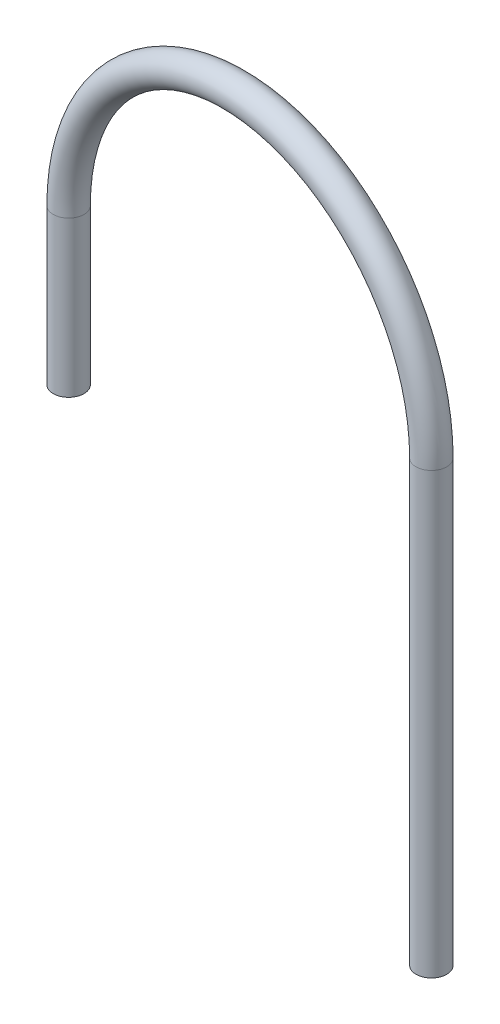
ISO-10303-21;
HEADER;
FILE_DESCRIPTION(('STEP AP214'),'2;1');
FILE_NAME('part.step','',(''),(''),'','','');
FILE_SCHEMA(('AUTOMOTIVE_DESIGN { 1 0 10303 214 1 1 1 1 }'));
ENDSEC;
DATA;
#1=APPLICATION_CONTEXT('core data for automotive mechanical design processes');
#2=APPLICATION_PROTOCOL_DEFINITION('international standard','automotive_design',2000,#1);
#3=PRODUCT_CONTEXT('',#1,'mechanical');
#4=PRODUCT('Part','Part','',(#3));
#5=PRODUCT_RELATED_PRODUCT_CATEGORY('part','',(#4));
#6=PRODUCT_DEFINITION_FORMATION('','',#4);
#7=PRODUCT_DEFINITION_CONTEXT('part definition',#1,'design');
#8=PRODUCT_DEFINITION('design','',#6,#7);
#9=PRODUCT_DEFINITION_SHAPE('','',#8);
#10=(LENGTH_UNIT() NAMED_UNIT(*) SI_UNIT(.MILLI.,.METRE.));
#11=(NAMED_UNIT(*) PLANE_ANGLE_UNIT() SI_UNIT($,.RADIAN.));
#12=(NAMED_UNIT(*) SI_UNIT($,.STERADIAN.) SOLID_ANGLE_UNIT());
#13=UNCERTAINTY_MEASURE_WITH_UNIT(LENGTH_MEASURE(1.E-05),#10,'distance_accuracy_value','');
#14=(GEOMETRIC_REPRESENTATION_CONTEXT(3) GLOBAL_UNCERTAINTY_ASSIGNED_CONTEXT((#13)) GLOBAL_UNIT_ASSIGNED_CONTEXT((#10,
#11,#12)) REPRESENTATION_CONTEXT('',''));
#15=CARTESIAN_POINT('',(0.,0.,0.));
#16=DIRECTION('',(0.,0.,1.));
#17=DIRECTION('',(1.,0.,0.));
#18=AXIS2_PLACEMENT_3D('',#15,#16,#17);
#19=CARTESIAN_POINT('',(-42.,165.,-59.25));
#20=DIRECTION('',(0.,-1.,0.));
#21=DIRECTION('',(-0.184305138259408,0.,0.982869073687427));
#22=AXIS2_PLACEMENT_3D('',#19,#20,#21);
#23=PLANE('',#22);
#24=CARTESIAN_POINT('',(-42.,165.,-59.25));
#25=DIRECTION('',(0.,-1.,0.));
#26=DIRECTION('',(0.,0.,-1.));
#27=AXIS2_PLACEMENT_3D('',#24,#25,#26);
#28=CIRCLE('',#27,2.);
#29=CARTESIAN_POINT('',(-42.,165.,-61.25));
#30=VERTEX_POINT('',#29);
#31=EDGE_CURVE('E66',#30,#30,#28,.T.);
#32=ORIENTED_EDGE('',*,*,#31,.F.);
#33=EDGE_LOOP('',(#32));
#34=FACE_BOUND('',#33,.T.);
#35=CARTESIAN_POINT('',(-42.,165.,-59.25));
#36=DIRECTION('',(0.,-1.,0.));
#37=DIRECTION('',(-0.184305138259408,0.,0.982869073687427));
#38=AXIS2_PLACEMENT_3D('',#35,#36,#37);
#39=CIRCLE('',#38,3.);
#40=CARTESIAN_POINT('',(-42.5529154147782,165.,-56.3013927789377));
#41=VERTEX_POINT('',#40);
#42=EDGE_CURVE('E57',#41,#41,#39,.T.);
#43=ORIENTED_EDGE('',*,*,#42,.T.);
#44=EDGE_LOOP('',(#43));
#45=FACE_BOUND('',#44,.T.);
#46=ADVANCED_FACE('F43',(#34,#45),#23,.T.);
#47=CARTESIAN_POINT('',(36.,109.55,-52.));
#48=DIRECTION('',(0.,1.,0.));
#49=DIRECTION('',(0.,0.,1.));
#50=AXIS2_PLACEMENT_3D('',#47,#48,#49);
#51=PLANE('',#50);
#52=CARTESIAN_POINT('',(36.,109.55,-52.));
#53=DIRECTION('',(0.,1.,0.));
#54=DIRECTION('',(0.,0.,1.));
#55=AXIS2_PLACEMENT_3D('',#52,#53,#54);
#56=CIRCLE('',#55,2.);
#57=CARTESIAN_POINT('',(36.,109.55,-50.));
#58=VERTEX_POINT('',#57);
#59=EDGE_CURVE('E62',#58,#58,#56,.T.);
#60=ORIENTED_EDGE('',*,*,#59,.T.);
#61=EDGE_LOOP('',(#60));
#62=FACE_BOUND('',#61,.T.);
#63=CARTESIAN_POINT('',(36.,109.55,-52.));
#64=DIRECTION('',(0.,1.,0.));
#65=DIRECTION('',(0.,0.,1.));
#66=AXIS2_PLACEMENT_3D('',#63,#64,#65);
#67=CIRCLE('',#66,3.);
#68=CARTESIAN_POINT('',(36.,109.55,-49.));
#69=VERTEX_POINT('',#68);
#70=EDGE_CURVE('E11',#69,#69,#67,.T.);
#71=ORIENTED_EDGE('',*,*,#70,.F.);
#72=EDGE_LOOP('',(#71));
#73=FACE_BOUND('',#72,.T.);
#74=ADVANCED_FACE('F86',(#62,#73),#51,.F.);
#75=CARTESIAN_POINT('',(-42.,165.,-59.25));
#76=DIRECTION('',(0.,1.,0.));
#77=DIRECTION('',(0.,0.,1.));
#78=AXIS2_PLACEMENT_3D('',#75,#76,#77);
#79=CYLINDRICAL_SURFACE('',#78,3.);
#80=CARTESIAN_POINT('',(-42.,195.275,-59.25));
#81=DIRECTION('',(0.,-1.,0.));
#82=DIRECTION('',(-0.184305138259408,0.,0.982869073687427));
#83=AXIS2_PLACEMENT_3D('',#80,#81,#82);
#84=CIRCLE('',#83,3.);
#85=CARTESIAN_POINT('',(-44.9871241741169,195.275,-59.5276493623378));
#86=VERTEX_POINT('',#85);
#87=EDGE_CURVE('E53',#86,#86,#84,.T.);
#88=ORIENTED_EDGE('',*,*,#87,.T.);
#89=EDGE_LOOP('',(#88));
#90=FACE_BOUND('',#89,.T.);
#91=ORIENTED_EDGE('',*,*,#42,.F.);
#92=EDGE_LOOP('',(#91));
#93=FACE_BOUND('',#92,.T.);
#94=ADVANCED_FACE('F90',(#90,#93),#79,.T.);
#95=CARTESIAN_POINT('',(-3.,195.275,-55.625));
#96=DIRECTION('',(0.0925497874459286,0.,-0.995708058038958));
#97=DIRECTION('',(-0.995708058038958,0.,-0.0925497874459286));
#98=AXIS2_PLACEMENT_3D('',#95,#96,#97);
#99=TOROIDAL_SURFACE('',#98,39.1681072430109,3.);
#100=CARTESIAN_POINT('',(36.,195.275,-52.));
#101=DIRECTION('',(0.,1.,0.));
#102=DIRECTION('',(0.,0.,1.));
#103=AXIS2_PLACEMENT_3D('',#100,#101,#102);
#104=CIRCLE('',#103,3.);
#105=CARTESIAN_POINT('',(38.9871241741169,195.275,-51.7223506376622));
#106=VERTEX_POINT('',#105);
#107=EDGE_CURVE('E49',#106,#106,#104,.T.);
#108=CARTESIAN_POINT('',(-3.,195.275,-55.625));
#109=DIRECTION('',(0.0925497874459286,0.,-0.995708058038958));
#110=DIRECTION('',(-0.995708058038958,0.,-0.0925497874459286));
#111=AXIS2_PLACEMENT_3D('',#108,#109,#110);
#112=CIRCLE('',#111,42.1681072430109);
#113=EDGE_CURVE('',#86,#106,#112,.T.);
#114=ORIENTED_EDGE('',*,*,#87,.F.);
#115=ORIENTED_EDGE('',*,*,#107,.T.);
#116=ORIENTED_EDGE('',*,*,#113,.T.);
#117=ORIENTED_EDGE('',*,*,#113,.F.);
#118=EDGE_LOOP('',(#114,#116,#115,#117));
#119=FACE_BOUND('',#118,.T.);
#120=ADVANCED_FACE('F92',(#119),#99,.T.);
#121=CARTESIAN_POINT('',(36.,195.275,-52.));
#122=DIRECTION('',(0.,-1.,0.));
#123=DIRECTION('',(0.,0.,-1.));
#124=AXIS2_PLACEMENT_3D('',#121,#122,#123);
#125=CYLINDRICAL_SURFACE('',#124,3.);
#126=ORIENTED_EDGE('',*,*,#70,.T.);
#127=EDGE_LOOP('',(#126));
#128=FACE_BOUND('',#127,.T.);
#129=ORIENTED_EDGE('',*,*,#107,.F.);
#130=EDGE_LOOP('',(#129));
#131=FACE_BOUND('',#130,.T.);
#132=ADVANCED_FACE('F80',(#128,#131),#125,.T.);
#133=CARTESIAN_POINT('',(-42.,165.,-59.25));
#134=DIRECTION('',(0.,1.,0.));
#135=DIRECTION('',(0.,0.,1.));
#136=AXIS2_PLACEMENT_3D('',#133,#134,#135);
#137=CYLINDRICAL_SURFACE('',#136,2.);
#138=CARTESIAN_POINT('',(-42.,195.275,-59.25));
#139=DIRECTION('',(0.,1.,0.));
#140=DIRECTION('',(0.,0.,1.));
#141=AXIS2_PLACEMENT_3D('',#138,#139,#140);
#142=CIRCLE('',#141,2.);
#143=CARTESIAN_POINT('',(-43.9914161160779,195.275,-59.4350995748919));
#144=VERTEX_POINT('',#143);
#145=EDGE_CURVE('E69',#144,#144,#142,.F.);
#146=ORIENTED_EDGE('',*,*,#145,.F.);
#147=EDGE_LOOP('',(#146));
#148=FACE_BOUND('',#147,.T.);
#149=ORIENTED_EDGE('',*,*,#31,.T.);
#150=EDGE_LOOP('',(#149));
#151=FACE_BOUND('',#150,.T.);
#152=ADVANCED_FACE('F77',(#148,#151),#137,.F.);
#153=CARTESIAN_POINT('',(-3.,195.275,-55.625));
#154=DIRECTION('',(0.0925497874459286,0.,-0.995708058038958));
#155=DIRECTION('',(-0.995708058038958,0.,-0.0925497874459286));
#156=AXIS2_PLACEMENT_3D('',#153,#154,#155);
#157=TOROIDAL_SURFACE('',#156,39.1681072430109,2.);
#158=CARTESIAN_POINT('',(36.,195.275,-52.));
#159=DIRECTION('',(0.,1.,0.));
#160=DIRECTION('',(-1.,0.,0.));
#161=AXIS2_PLACEMENT_3D('',#158,#159,#160);
#162=CIRCLE('',#161,2.);
#163=CARTESIAN_POINT('',(37.9914161160779,195.275,-51.8149004251082));
#164=VERTEX_POINT('',#163);
#165=EDGE_CURVE('E65',#164,#164,#162,.T.);
#166=CARTESIAN_POINT('',(-3.,195.275,-55.625));
#167=DIRECTION('',(0.0925497874459286,0.,-0.995708058038958));
#168=DIRECTION('',(-0.995708058038958,0.,-0.0925497874459286));
#169=AXIS2_PLACEMENT_3D('',#166,#167,#168);
#170=CIRCLE('',#169,41.1681072430109);
#171=EDGE_CURVE('',#144,#164,#170,.T.);
#172=ORIENTED_EDGE('',*,*,#145,.T.);
#173=ORIENTED_EDGE('',*,*,#165,.F.);
#174=ORIENTED_EDGE('',*,*,#171,.T.);
#175=ORIENTED_EDGE('',*,*,#171,.F.);
#176=EDGE_LOOP('',(#172,#174,#173,#175));
#177=FACE_BOUND('',#176,.T.);
#178=ADVANCED_FACE('F75',(#177),#157,.F.);
#179=CARTESIAN_POINT('',(36.,195.275,-52.));
#180=DIRECTION('',(0.,-1.,0.));
#181=DIRECTION('',(0.,0.,-1.));
#182=AXIS2_PLACEMENT_3D('',#179,#180,#181);
#183=CYLINDRICAL_SURFACE('',#182,2.);
#184=ORIENTED_EDGE('',*,*,#59,.F.);
#185=EDGE_LOOP('',(#184));
#186=FACE_BOUND('',#185,.T.);
#187=ORIENTED_EDGE('',*,*,#165,.T.);
#188=EDGE_LOOP('',(#187));
#189=FACE_BOUND('',#188,.T.);
#190=ADVANCED_FACE('F87',(#186,#189),#183,.F.);
#191=CLOSED_SHELL('',(#46,#74,#94,#120,#132,#152,#178,#190));
#192=MANIFOLD_SOLID_BREP('B2',#191);
#193=ADVANCED_BREP_SHAPE_REPRESENTATION('',(#18,#192),#14);
#194=SHAPE_DEFINITION_REPRESENTATION(#9,#193);
ENDSEC;
END-ISO-10303-21;
